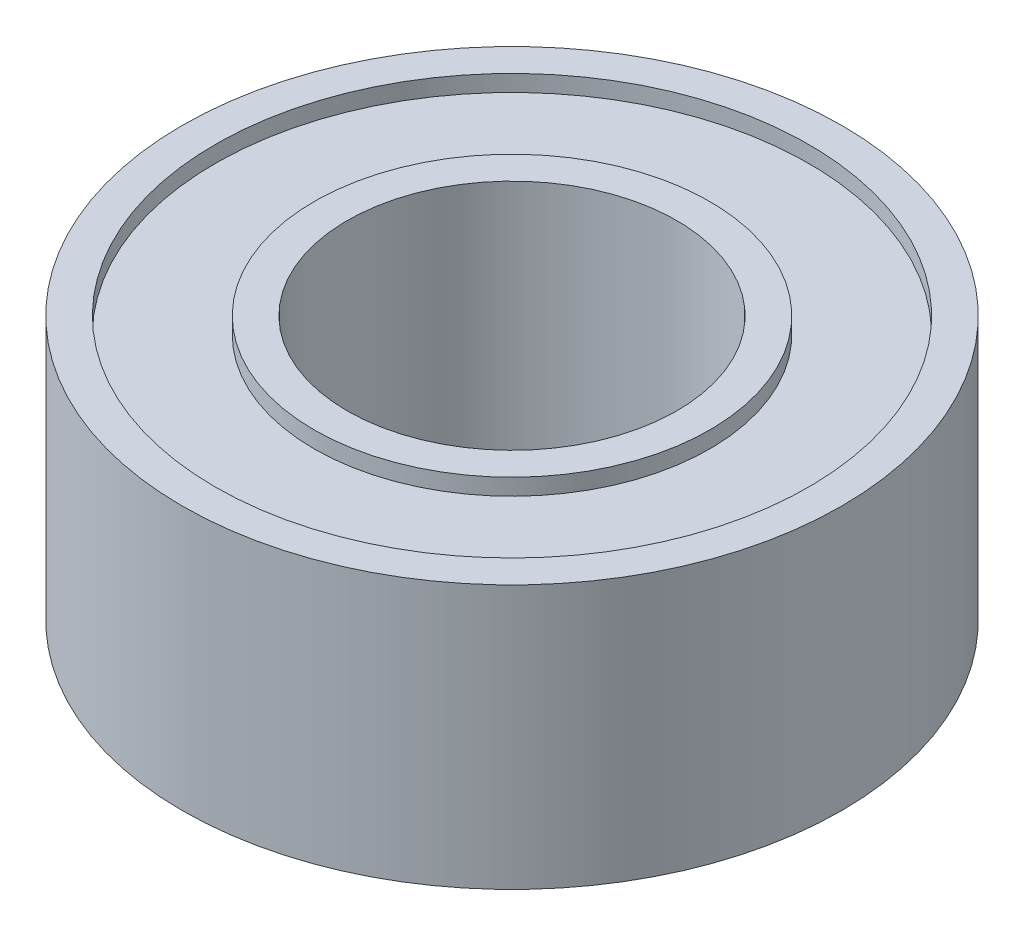
ISO-10303-21;
HEADER;
FILE_DESCRIPTION(('STEP AP214'),'2;1');
FILE_NAME('part.step','',(''),(''),'','','');
FILE_SCHEMA(('AUTOMOTIVE_DESIGN { 1 0 10303 214 1 1 1 1 }'));
ENDSEC;
DATA;
#1=APPLICATION_CONTEXT('core data for automotive mechanical design processes');
#2=APPLICATION_PROTOCOL_DEFINITION('international standard','automotive_design',2000,#1);
#3=PRODUCT_CONTEXT('',#1,'mechanical');
#4=PRODUCT('Part','Part','',(#3));
#5=PRODUCT_RELATED_PRODUCT_CATEGORY('part','',(#4));
#6=PRODUCT_DEFINITION_FORMATION('','',#4);
#7=PRODUCT_DEFINITION_CONTEXT('part definition',#1,'design');
#8=PRODUCT_DEFINITION('design','',#6,#7);
#9=PRODUCT_DEFINITION_SHAPE('','',#8);
#10=(LENGTH_UNIT() NAMED_UNIT(*) SI_UNIT(.MILLI.,.METRE.));
#11=(NAMED_UNIT(*) PLANE_ANGLE_UNIT() SI_UNIT($,.RADIAN.));
#12=(NAMED_UNIT(*) SI_UNIT($,.STERADIAN.) SOLID_ANGLE_UNIT());
#13=UNCERTAINTY_MEASURE_WITH_UNIT(LENGTH_MEASURE(1.E-05),#10,'distance_accuracy_value','');
#14=(GEOMETRIC_REPRESENTATION_CONTEXT(3) GLOBAL_UNCERTAINTY_ASSIGNED_CONTEXT((#13)) GLOBAL_UNIT_ASSIGNED_CONTEXT((#10,
#11,#12)) REPRESENTATION_CONTEXT('',''));
#15=CARTESIAN_POINT('',(0.,0.,0.));
#16=DIRECTION('',(0.,0.,1.));
#17=DIRECTION('',(1.,0.,0.));
#18=AXIS2_PLACEMENT_3D('',#15,#16,#17);
#19=CARTESIAN_POINT('',(0.,-2.,0.));
#20=DIRECTION('',(0.,1.,0.));
#21=DIRECTION('',(0.,0.,1.));
#22=AXIS2_PLACEMENT_3D('',#19,#20,#21);
#23=PLANE('',#22);
#24=CARTESIAN_POINT('',(0.,-2.,0.));
#25=DIRECTION('',(0.,1.,0.));
#26=DIRECTION('',(0.,0.,1.));
#27=AXIS2_PLACEMENT_3D('',#24,#25,#26);
#28=CIRCLE('',#27,2.5);
#29=CARTESIAN_POINT('',(0.,-2.,2.5));
#30=VERTEX_POINT('',#29);
#31=EDGE_CURVE('E46',#30,#30,#28,.T.);
#32=ORIENTED_EDGE('',*,*,#31,.T.);
#33=EDGE_LOOP('',(#32));
#34=FACE_BOUND('',#33,.T.);
#35=CARTESIAN_POINT('',(0.,-2.,0.));
#36=DIRECTION('',(0.,1.,0.));
#37=DIRECTION('',(0.,0.,1.));
#38=AXIS2_PLACEMENT_3D('',#35,#36,#37);
#39=CIRCLE('',#38,3.);
#40=CARTESIAN_POINT('',(0.,-2.,3.));
#41=VERTEX_POINT('',#40);
#42=EDGE_CURVE('E70',#41,#41,#39,.T.);
#43=ORIENTED_EDGE('',*,*,#42,.F.);
#44=EDGE_LOOP('',(#43));
#45=FACE_BOUND('',#44,.T.);
#46=ADVANCED_FACE('F33',(#34,#45),#23,.F.);
#47=CARTESIAN_POINT('',(0.,2.,0.));
#48=DIRECTION('',(0.,1.,0.));
#49=DIRECTION('',(0.,0.,1.));
#50=AXIS2_PLACEMENT_3D('',#47,#48,#49);
#51=PLANE('',#50);
#52=CARTESIAN_POINT('',(0.,2.,0.));
#53=DIRECTION('',(0.,1.,0.));
#54=DIRECTION('',(0.,0.,1.));
#55=AXIS2_PLACEMENT_3D('',#52,#53,#54);
#56=CIRCLE('',#55,2.5);
#57=CARTESIAN_POINT('',(0.,2.,2.5));
#58=VERTEX_POINT('',#57);
#59=EDGE_CURVE('E44',#58,#58,#56,.T.);
#60=ORIENTED_EDGE('',*,*,#59,.F.);
#61=EDGE_LOOP('',(#60));
#62=FACE_BOUND('',#61,.T.);
#63=CARTESIAN_POINT('',(0.,2.,0.));
#64=DIRECTION('',(0.,1.,0.));
#65=DIRECTION('',(0.,0.,1.));
#66=AXIS2_PLACEMENT_3D('',#63,#64,#65);
#67=CIRCLE('',#66,3.);
#68=CARTESIAN_POINT('',(0.,2.,3.));
#69=VERTEX_POINT('',#68);
#70=EDGE_CURVE('E58',#69,#69,#67,.T.);
#71=ORIENTED_EDGE('',*,*,#70,.T.);
#72=EDGE_LOOP('',(#71));
#73=FACE_BOUND('',#72,.T.);
#74=ADVANCED_FACE('F86',(#62,#73),#51,.T.);
#75=CARTESIAN_POINT('',(0.,2.,0.));
#76=DIRECTION('',(0.,1.,0.));
#77=DIRECTION('',(0.,0.,1.));
#78=AXIS2_PLACEMENT_3D('',#75,#76,#77);
#79=CIRCLE('',#78,4.5);
#80=CARTESIAN_POINT('',(0.,2.,4.5));
#81=VERTEX_POINT('',#80);
#82=EDGE_CURVE('E52',#81,#81,#79,.T.);
#83=ORIENTED_EDGE('',*,*,#82,.F.);
#84=EDGE_LOOP('',(#83));
#85=FACE_BOUND('',#84,.T.);
#86=CARTESIAN_POINT('',(0.,2.,0.));
#87=DIRECTION('',(0.,1.,0.));
#88=DIRECTION('',(0.,0.,1.));
#89=AXIS2_PLACEMENT_3D('',#86,#87,#88);
#90=CIRCLE('',#89,5.);
#91=CARTESIAN_POINT('',(0.,2.,5.));
#92=VERTEX_POINT('',#91);
#93=EDGE_CURVE('E10',#92,#92,#90,.T.);
#94=ORIENTED_EDGE('',*,*,#93,.T.);
#95=EDGE_LOOP('',(#94));
#96=FACE_BOUND('',#95,.T.);
#97=ADVANCED_FACE('F92',(#85,#96),#51,.T.);
#98=CARTESIAN_POINT('',(0.,-2.,0.));
#99=DIRECTION('',(0.,1.,0.));
#100=DIRECTION('',(0.,0.,1.));
#101=AXIS2_PLACEMENT_3D('',#98,#99,#100);
#102=CIRCLE('',#101,4.5);
#103=CARTESIAN_POINT('',(0.,-2.,4.5));
#104=VERTEX_POINT('',#103);
#105=EDGE_CURVE('E64',#104,#104,#102,.T.);
#106=ORIENTED_EDGE('',*,*,#105,.T.);
#107=EDGE_LOOP('',(#106));
#108=FACE_BOUND('',#107,.T.);
#109=CARTESIAN_POINT('',(0.,-2.,0.));
#110=DIRECTION('',(0.,1.,0.));
#111=DIRECTION('',(0.,0.,1.));
#112=AXIS2_PLACEMENT_3D('',#109,#110,#111);
#113=CIRCLE('',#112,5.);
#114=CARTESIAN_POINT('',(0.,-2.,5.));
#115=VERTEX_POINT('',#114);
#116=EDGE_CURVE('E37',#115,#115,#113,.T.);
#117=ORIENTED_EDGE('',*,*,#116,.F.);
#118=EDGE_LOOP('',(#117));
#119=FACE_BOUND('',#118,.T.);
#120=ADVANCED_FACE('F88',(#108,#119),#23,.F.);
#121=CARTESIAN_POINT('',(0.,2.,0.));
#122=DIRECTION('',(0.,-1.,0.));
#123=DIRECTION('',(0.,0.,-1.));
#124=AXIS2_PLACEMENT_3D('',#121,#122,#123);
#125=CYLINDRICAL_SURFACE('',#124,5.);
#126=ORIENTED_EDGE('',*,*,#93,.F.);
#127=EDGE_LOOP('',(#126));
#128=FACE_BOUND('',#127,.T.);
#129=ORIENTED_EDGE('',*,*,#116,.T.);
#130=EDGE_LOOP('',(#129));
#131=FACE_BOUND('',#130,.T.);
#132=ADVANCED_FACE('F35',(#128,#131),#125,.T.);
#133=CARTESIAN_POINT('',(0.,2.,0.));
#134=DIRECTION('',(0.,-1.,0.));
#135=DIRECTION('',(0.,0.,-1.));
#136=AXIS2_PLACEMENT_3D('',#133,#134,#135);
#137=CYLINDRICAL_SURFACE('',#136,2.5);
#138=ORIENTED_EDGE('',*,*,#59,.T.);
#139=EDGE_LOOP('',(#138));
#140=FACE_BOUND('',#139,.T.);
#141=ORIENTED_EDGE('',*,*,#31,.F.);
#142=EDGE_LOOP('',(#141));
#143=FACE_BOUND('',#142,.T.);
#144=ADVANCED_FACE('F101',(#140,#143),#137,.F.);
#145=CARTESIAN_POINT('',(0.,1.75,0.));
#146=DIRECTION('',(0.,1.,0.));
#147=DIRECTION('',(0.,0.,1.));
#148=AXIS2_PLACEMENT_3D('',#145,#146,#147);
#149=CYLINDRICAL_SURFACE('',#148,4.5);
#150=CARTESIAN_POINT('',(0.,1.75,0.));
#151=DIRECTION('',(0.,1.,0.));
#152=DIRECTION('',(0.,0.,1.));
#153=AXIS2_PLACEMENT_3D('',#150,#151,#152);
#154=CIRCLE('',#153,4.5);
#155=CARTESIAN_POINT('',(0.,1.75,4.5));
#156=VERTEX_POINT('',#155);
#157=EDGE_CURVE('E49',#156,#156,#154,.T.);
#158=ORIENTED_EDGE('',*,*,#157,.F.);
#159=EDGE_LOOP('',(#158));
#160=FACE_BOUND('',#159,.T.);
#161=ORIENTED_EDGE('',*,*,#82,.T.);
#162=EDGE_LOOP('',(#161));
#163=FACE_BOUND('',#162,.T.);
#164=ADVANCED_FACE('F125',(#160,#163),#149,.F.);
#165=CARTESIAN_POINT('',(0.,1.75,0.));
#166=DIRECTION('',(0.,1.,0.));
#167=DIRECTION('',(0.,0.,1.));
#168=AXIS2_PLACEMENT_3D('',#165,#166,#167);
#169=PLANE('',#168);
#170=CARTESIAN_POINT('',(0.,1.75,0.));
#171=DIRECTION('',(0.,1.,0.));
#172=DIRECTION('',(0.,0.,1.));
#173=AXIS2_PLACEMENT_3D('',#170,#171,#172);
#174=CIRCLE('',#173,3.);
#175=CARTESIAN_POINT('',(0.,1.75,3.));
#176=VERTEX_POINT('',#175);
#177=EDGE_CURVE('E55',#176,#176,#174,.T.);
#178=ORIENTED_EDGE('',*,*,#177,.F.);
#179=EDGE_LOOP('',(#178));
#180=FACE_BOUND('',#179,.T.);
#181=ORIENTED_EDGE('',*,*,#157,.T.);
#182=EDGE_LOOP('',(#181));
#183=FACE_BOUND('',#182,.T.);
#184=ADVANCED_FACE('F121',(#180,#183),#169,.T.);
#185=CARTESIAN_POINT('',(0.,1.75,0.));
#186=DIRECTION('',(0.,1.,0.));
#187=DIRECTION('',(0.,0.,1.));
#188=AXIS2_PLACEMENT_3D('',#185,#186,#187);
#189=CYLINDRICAL_SURFACE('',#188,3.);
#190=ORIENTED_EDGE('',*,*,#177,.T.);
#191=EDGE_LOOP('',(#190));
#192=FACE_BOUND('',#191,.T.);
#193=ORIENTED_EDGE('',*,*,#70,.F.);
#194=EDGE_LOOP('',(#193));
#195=FACE_BOUND('',#194,.T.);
#196=ADVANCED_FACE('F115',(#192,#195),#189,.T.);
#197=CARTESIAN_POINT('',(0.,-1.75,0.));
#198=DIRECTION('',(0.,-1.,0.));
#199=DIRECTION('',(0.,0.,1.));
#200=AXIS2_PLACEMENT_3D('',#197,#198,#199);
#201=PLANE('',#200);
#202=CARTESIAN_POINT('',(0.,-1.75,0.));
#203=DIRECTION('',(0.,1.,0.));
#204=DIRECTION('',(0.,0.,1.));
#205=AXIS2_PLACEMENT_3D('',#202,#203,#204);
#206=CIRCLE('',#205,4.5);
#207=CARTESIAN_POINT('',(0.,-1.75,4.5));
#208=VERTEX_POINT('',#207);
#209=EDGE_CURVE('E61',#208,#208,#206,.T.);
#210=ORIENTED_EDGE('',*,*,#209,.F.);
#211=EDGE_LOOP('',(#210));
#212=FACE_BOUND('',#211,.T.);
#213=CARTESIAN_POINT('',(0.,-1.75,0.));
#214=DIRECTION('',(0.,1.,0.));
#215=DIRECTION('',(0.,0.,1.));
#216=AXIS2_PLACEMENT_3D('',#213,#214,#215);
#217=CIRCLE('',#216,3.);
#218=CARTESIAN_POINT('',(0.,-1.75,3.));
#219=VERTEX_POINT('',#218);
#220=EDGE_CURVE('E67',#219,#219,#217,.T.);
#221=ORIENTED_EDGE('',*,*,#220,.T.);
#222=EDGE_LOOP('',(#221));
#223=FACE_BOUND('',#222,.T.);
#224=ADVANCED_FACE('F76',(#212,#223),#201,.T.);
#225=CARTESIAN_POINT('',(0.,-1.75,0.));
#226=DIRECTION('',(0.,-1.,0.));
#227=DIRECTION('',(0.,0.,-1.));
#228=AXIS2_PLACEMENT_3D('',#225,#226,#227);
#229=CYLINDRICAL_SURFACE('',#228,4.5);
#230=ORIENTED_EDGE('',*,*,#209,.T.);
#231=EDGE_LOOP('',(#230));
#232=FACE_BOUND('',#231,.T.);
#233=ORIENTED_EDGE('',*,*,#105,.F.);
#234=EDGE_LOOP('',(#233));
#235=FACE_BOUND('',#234,.T.);
#236=ADVANCED_FACE('F81',(#232,#235),#229,.F.);
#237=CARTESIAN_POINT('',(0.,-1.75,0.));
#238=DIRECTION('',(0.,-1.,0.));
#239=DIRECTION('',(0.,0.,-1.));
#240=AXIS2_PLACEMENT_3D('',#237,#238,#239);
#241=CYLINDRICAL_SURFACE('',#240,3.);
#242=ORIENTED_EDGE('',*,*,#220,.F.);
#243=EDGE_LOOP('',(#242));
#244=FACE_BOUND('',#243,.T.);
#245=ORIENTED_EDGE('',*,*,#42,.T.);
#246=EDGE_LOOP('',(#245));
#247=FACE_BOUND('',#246,.T.);
#248=ADVANCED_FACE('F78',(#244,#247),#241,.T.);
#249=CLOSED_SHELL('',(#46,#74,#97,#120,#132,#144,#164,#184,#196,#224,#236,#248));
#250=MANIFOLD_SOLID_BREP('B2',#249);
#251=ADVANCED_BREP_SHAPE_REPRESENTATION('',(#18,#250),#14);
#252=SHAPE_DEFINITION_REPRESENTATION(#9,#251);
ENDSEC;
END-ISO-10303-21;
